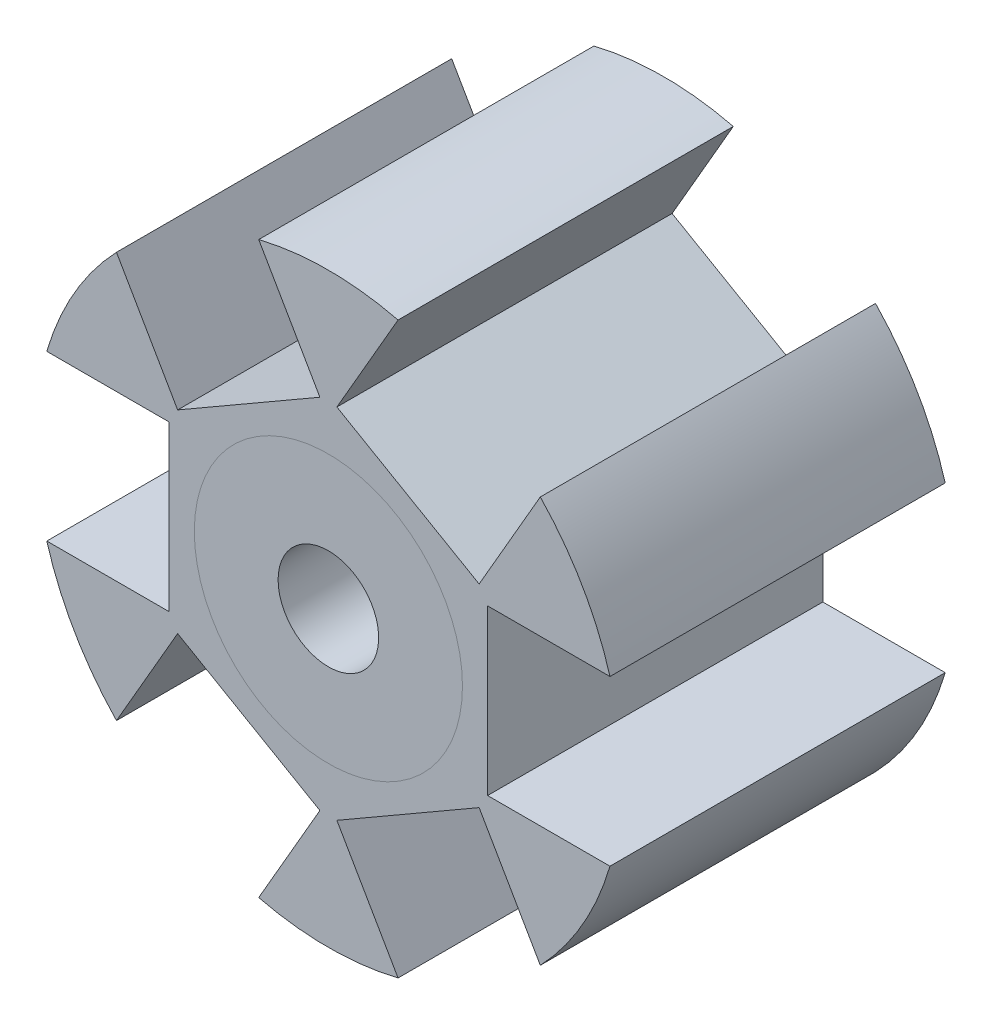
ISO-10303-21;
HEADER;
FILE_DESCRIPTION(('STEP AP214'),'2;1');
FILE_NAME('part.step','',(''),(''),'','','');
FILE_SCHEMA(('AUTOMOTIVE_DESIGN { 1 0 10303 214 1 1 1 1 }'));
ENDSEC;
DATA;
#1=APPLICATION_CONTEXT('core data for automotive mechanical design processes');
#2=APPLICATION_PROTOCOL_DEFINITION('international standard','automotive_design',2000,#1);
#3=PRODUCT_CONTEXT('',#1,'mechanical');
#4=PRODUCT('Part','Part','',(#3));
#5=PRODUCT_RELATED_PRODUCT_CATEGORY('part','',(#4));
#6=PRODUCT_DEFINITION_FORMATION('','',#4);
#7=PRODUCT_DEFINITION_CONTEXT('part definition',#1,'design');
#8=PRODUCT_DEFINITION('design','',#6,#7);
#9=PRODUCT_DEFINITION_SHAPE('','',#8);
#10=(LENGTH_UNIT() NAMED_UNIT(*) SI_UNIT(.MILLI.,.METRE.));
#11=(NAMED_UNIT(*) PLANE_ANGLE_UNIT() SI_UNIT($,.RADIAN.));
#12=(NAMED_UNIT(*) SI_UNIT($,.STERADIAN.) SOLID_ANGLE_UNIT());
#13=UNCERTAINTY_MEASURE_WITH_UNIT(LENGTH_MEASURE(1.E-05),#10,'distance_accuracy_value','');
#14=(GEOMETRIC_REPRESENTATION_CONTEXT(3) GLOBAL_UNCERTAINTY_ASSIGNED_CONTEXT((#13)) GLOBAL_UNIT_ASSIGNED_CONTEXT((#10,
#11,#12)) REPRESENTATION_CONTEXT('',''));
#15=CARTESIAN_POINT('',(0.,0.,0.));
#16=DIRECTION('',(0.,0.,1.));
#17=DIRECTION('',(1.,0.,0.));
#18=AXIS2_PLACEMENT_3D('',#15,#16,#17);
#19=CARTESIAN_POINT('',(0.,0.,2.));
#20=DIRECTION('',(0.,0.,1.));
#21=DIRECTION('',(-1.,0.,0.));
#22=AXIS2_PLACEMENT_3D('',#19,#20,#21);
#23=CYLINDRICAL_SURFACE('',#22,4.);
#24=CARTESIAN_POINT('',(0.,0.,5.));
#25=DIRECTION('',(0.,0.,-1.));
#26=DIRECTION('',(-1.,0.,0.));
#27=AXIS2_PLACEMENT_3D('',#24,#25,#26);
#28=CIRCLE('',#27,4.);
#29=CARTESIAN_POINT('',(-4.,0.,5.));
#30=VERTEX_POINT('',#29);
#31=EDGE_CURVE('P0_E52',#30,#30,#28,.T.);
#32=ORIENTED_EDGE('',*,*,#31,.T.);
#33=EDGE_LOOP('',(#32));
#34=FACE_BOUND('',#33,.T.);
#35=CARTESIAN_POINT('',(0.,0.,2.));
#36=DIRECTION('',(0.,0.,-1.));
#37=DIRECTION('',(-1.,0.,0.));
#38=AXIS2_PLACEMENT_3D('',#35,#36,#37);
#39=CIRCLE('',#38,4.);
#40=CARTESIAN_POINT('',(-4.,0.,2.));
#41=VERTEX_POINT('',#40);
#42=EDGE_CURVE('P0_E11',#41,#41,#39,.T.);
#43=ORIENTED_EDGE('',*,*,#42,.F.);
#44=EDGE_LOOP('',(#43));
#45=FACE_BOUND('',#44,.T.);
#46=ADVANCED_FACE('P0_F49',(#34,#45),#23,.T.);
#47=CARTESIAN_POINT('',(0.,0.,2.));
#48=DIRECTION('',(0.,0.,1.));
#49=DIRECTION('',(-1.,0.,0.));
#50=AXIS2_PLACEMENT_3D('',#47,#48,#49);
#51=PLANE('',#50);
#52=CARTESIAN_POINT('',(0.,0.,2.));
#53=DIRECTION('',(0.,0.,-1.));
#54=DIRECTION('',(-1.,0.,0.));
#55=AXIS2_PLACEMENT_3D('',#52,#53,#54);
#56=CIRCLE('',#55,1.5);
#57=CARTESIAN_POINT('',(-1.5,0.,2.));
#58=VERTEX_POINT('',#57);
#59=EDGE_CURVE('P0_E59',#58,#58,#56,.T.);
#60=ORIENTED_EDGE('',*,*,#59,.F.);
#61=EDGE_LOOP('',(#60));
#62=FACE_BOUND('',#61,.T.);
#63=ORIENTED_EDGE('',*,*,#42,.T.);
#64=EDGE_LOOP('',(#63));
#65=FACE_BOUND('',#64,.T.);
#66=ADVANCED_FACE('P0_F70',(#62,#65),#51,.F.);
#67=CARTESIAN_POINT('',(0.,0.,5.));
#68=DIRECTION('',(0.,0.,1.));
#69=DIRECTION('',(-1.,0.,0.));
#70=AXIS2_PLACEMENT_3D('',#67,#68,#69);
#71=PLANE('',#70);
#72=CARTESIAN_POINT('',(0.,0.,5.));
#73=DIRECTION('',(0.,0.,-1.));
#74=DIRECTION('',(-1.,0.,0.));
#75=AXIS2_PLACEMENT_3D('',#72,#73,#74);
#76=CIRCLE('',#75,1.5);
#77=CARTESIAN_POINT('',(-1.5,0.,5.));
#78=VERTEX_POINT('',#77);
#79=EDGE_CURVE('P0_E61',#78,#78,#76,.T.);
#80=ORIENTED_EDGE('',*,*,#79,.T.);
#81=EDGE_LOOP('',(#80));
#82=FACE_BOUND('',#81,.T.);
#83=ORIENTED_EDGE('',*,*,#31,.F.);
#84=EDGE_LOOP('',(#83));
#85=FACE_BOUND('',#84,.T.);
#86=ADVANCED_FACE('P0_F72',(#82,#85),#71,.T.);
#87=CARTESIAN_POINT('',(0.,0.,2.));
#88=DIRECTION('',(0.,0.,1.));
#89=DIRECTION('',(-1.,0.,0.));
#90=AXIS2_PLACEMENT_3D('',#87,#88,#89);
#91=CYLINDRICAL_SURFACE('',#90,1.5);
#92=ORIENTED_EDGE('',*,*,#59,.T.);
#93=EDGE_LOOP('',(#92));
#94=FACE_BOUND('',#93,.T.);
#95=ORIENTED_EDGE('',*,*,#79,.F.);
#96=EDGE_LOOP('',(#95));
#97=FACE_BOUND('',#96,.T.);
#98=ADVANCED_FACE('P0_F67',(#94,#97),#91,.F.);
#99=CLOSED_SHELL('',(#46,#66,#86,#98));
#100=MANIFOLD_SOLID_BREP('P0_B2',#99);
#101=CARTESIAN_POINT('',(0.,0.,-2.));
#102=DIRECTION('',(0.,0.,-1.));
#103=DIRECTION('',(-1.,0.,0.));
#104=AXIS2_PLACEMENT_3D('',#101,#102,#103);
#105=CYLINDRICAL_SURFACE('',#104,4.);
#106=CARTESIAN_POINT('',(0.,0.,-5.));
#107=DIRECTION('',(0.,0.,-1.));
#108=DIRECTION('',(-1.,0.,0.));
#109=AXIS2_PLACEMENT_3D('',#106,#107,#108);
#110=CIRCLE('',#109,4.);
#111=CARTESIAN_POINT('',(-4.,0.,-5.));
#112=VERTEX_POINT('',#111);
#113=EDGE_CURVE('P0_E117',#112,#112,#110,.T.);
#114=ORIENTED_EDGE('',*,*,#113,.F.);
#115=EDGE_LOOP('',(#114));
#116=FACE_BOUND('',#115,.T.);
#117=CARTESIAN_POINT('',(0.,0.,-2.));
#118=DIRECTION('',(0.,0.,-1.));
#119=DIRECTION('',(-1.,0.,0.));
#120=AXIS2_PLACEMENT_3D('',#117,#118,#119);
#121=CIRCLE('',#120,4.);
#122=CARTESIAN_POINT('',(-4.,0.,-2.));
#123=VERTEX_POINT('',#122);
#124=EDGE_CURVE('P0_E48',#123,#123,#121,.T.);
#125=ORIENTED_EDGE('',*,*,#124,.T.);
#126=EDGE_LOOP('',(#125));
#127=FACE_BOUND('',#126,.T.);
#128=ADVANCED_FACE('P0_F114',(#116,#127),#105,.T.);
#129=CARTESIAN_POINT('',(0.,0.,-2.));
#130=DIRECTION('',(0.,0.,-1.));
#131=DIRECTION('',(-1.,0.,0.));
#132=AXIS2_PLACEMENT_3D('',#129,#130,#131);
#133=PLANE('',#132);
#134=CARTESIAN_POINT('',(0.,0.,-2.));
#135=DIRECTION('',(0.,0.,-1.));
#136=DIRECTION('',(-1.,0.,0.));
#137=AXIS2_PLACEMENT_3D('',#134,#135,#136);
#138=CIRCLE('',#137,1.5);
#139=CARTESIAN_POINT('',(-1.5,0.,-2.));
#140=VERTEX_POINT('',#139);
#141=EDGE_CURVE('P0_E124',#140,#140,#138,.T.);
#142=ORIENTED_EDGE('',*,*,#141,.T.);
#143=EDGE_LOOP('',(#142));
#144=FACE_BOUND('',#143,.T.);
#145=ORIENTED_EDGE('',*,*,#124,.F.);
#146=EDGE_LOOP('',(#145));
#147=FACE_BOUND('',#146,.T.);
#148=ADVANCED_FACE('P0_F132',(#144,#147),#133,.F.);
#149=CARTESIAN_POINT('',(0.,0.,-5.));
#150=DIRECTION('',(0.,0.,-1.));
#151=DIRECTION('',(-1.,0.,0.));
#152=AXIS2_PLACEMENT_3D('',#149,#150,#151);
#153=PLANE('',#152);
#154=CARTESIAN_POINT('',(0.,0.,-5.));
#155=DIRECTION('',(0.,0.,-1.));
#156=DIRECTION('',(-1.,0.,0.));
#157=AXIS2_PLACEMENT_3D('',#154,#155,#156);
#158=CIRCLE('',#157,1.5);
#159=CARTESIAN_POINT('',(-1.5,0.,-5.));
#160=VERTEX_POINT('',#159);
#161=EDGE_CURVE('P0_E126',#160,#160,#158,.T.);
#162=ORIENTED_EDGE('',*,*,#161,.F.);
#163=EDGE_LOOP('',(#162));
#164=FACE_BOUND('',#163,.T.);
#165=ORIENTED_EDGE('',*,*,#113,.T.);
#166=EDGE_LOOP('',(#165));
#167=FACE_BOUND('',#166,.T.);
#168=ADVANCED_FACE('P0_F138',(#164,#167),#153,.T.);
#169=CARTESIAN_POINT('',(0.,0.,-2.));
#170=DIRECTION('',(0.,0.,-1.));
#171=DIRECTION('',(-1.,0.,0.));
#172=AXIS2_PLACEMENT_3D('',#169,#170,#171);
#173=CYLINDRICAL_SURFACE('',#172,1.5);
#174=ORIENTED_EDGE('',*,*,#141,.F.);
#175=EDGE_LOOP('',(#174));
#176=FACE_BOUND('',#175,.T.);
#177=ORIENTED_EDGE('',*,*,#161,.T.);
#178=EDGE_LOOP('',(#177));
#179=FACE_BOUND('',#178,.T.);
#180=ADVANCED_FACE('P0_F135',(#176,#179),#173,.F.);
#181=CLOSED_SHELL('',(#128,#148,#168,#180));
#182=MANIFOLD_SOLID_BREP('P0_B6',#181);
#183=CARTESIAN_POINT('',(-2.37500000000005,4.11362066797605,0.));
#184=DIRECTION('',(-0.50000000000001,0.866025403784433,0.));
#185=DIRECTION('',(0.,0.,1.));
#186=AXIS2_PLACEMENT_3D('',#183,#184,#185);
#187=PLANE('',#186);
#188=DIRECTION('',(0.,0.,-1.));
#189=VECTOR('',#188,1.);
#190=CARTESIAN_POINT('',(-4.49676223927191,2.88862066797603,5.));
#191=LINE('',#190,#189);
#192=CARTESIAN_POINT('',(-4.49676223927191,2.88862066797603,5.));
#193=VERTEX_POINT('',#192);
#194=CARTESIAN_POINT('',(-4.49676223927191,2.88862066797603,-5.));
#195=VERTEX_POINT('',#194);
#196=EDGE_CURVE('P1_E26',#193,#195,#191,.T.);
#197=ORIENTED_EDGE('',*,*,#196,.F.);
#198=DIRECTION('',(-0.866025403784433,-0.50000000000001,0.));
#199=VECTOR('',#198,1.);
#200=CARTESIAN_POINT('',(-0.253237760728186,5.33862066797608,5.));
#201=LINE('',#200,#199);
#202=CARTESIAN_POINT('',(-0.253237760728186,5.33862066797608,5.));
#203=VERTEX_POINT('',#202);
#204=EDGE_CURVE('P1_E505',#203,#193,#201,.T.);
#205=ORIENTED_EDGE('',*,*,#204,.F.);
#206=DIRECTION('',(0.,0.,1.));
#207=VECTOR('',#206,1.);
#208=CARTESIAN_POINT('',(-0.253237760728186,5.33862066797608,5.));
#209=LINE('',#208,#207);
#210=CARTESIAN_POINT('',(-0.253237760728186,5.33862066797608,-5.));
#211=VERTEX_POINT('',#210);
#212=EDGE_CURVE('P1_E11',#211,#203,#209,.T.);
#213=ORIENTED_EDGE('',*,*,#212,.F.);
#214=DIRECTION('',(0.866025403784433,0.50000000000001,0.));
#215=VECTOR('',#214,1.);
#216=CARTESIAN_POINT('',(-0.253237760728186,5.33862066797608,-5.));
#217=LINE('',#216,#215);
#218=EDGE_CURVE('P1_E366',#195,#211,#217,.T.);
#219=ORIENTED_EDGE('',*,*,#218,.F.);
#220=EDGE_LOOP('',(#197,#205,#213,#219));
#221=FACE_BOUND('',#220,.T.);
#222=ADVANCED_FACE('P1_F17',(#221),#187,.T.);
#223=CARTESIAN_POINT('',(-0.253237760728186,5.33862066797608,5.));
#224=DIRECTION('',(-0.866025403784433,-0.50000000000001,0.));
#225=DIRECTION('',(-0.50000000000001,0.866025403784433,0.));
#226=AXIS2_PLACEMENT_3D('',#223,#224,#225);
#227=PLANE('',#226);
#228=DIRECTION('',(0.,0.,-1.));
#229=VECTOR('',#228,1.);
#230=CARTESIAN_POINT('',(-2.07823776072823,8.49961339178926,5.));
#231=LINE('',#230,#229);
#232=CARTESIAN_POINT('',(-2.07823776072823,8.49961339178926,5.));
#233=VERTEX_POINT('',#232);
#234=CARTESIAN_POINT('',(-2.07823776072823,8.49961339178926,-5.));
#235=VERTEX_POINT('',#234);
#236=EDGE_CURVE('P1_E343',#233,#235,#231,.T.);
#237=ORIENTED_EDGE('',*,*,#236,.T.);
#238=DIRECTION('',(-0.50000000000001,0.866025403784433,0.));
#239=VECTOR('',#238,1.);
#240=CARTESIAN_POINT('',(-0.253237760728186,5.33862066797608,-5.));
#241=LINE('',#240,#239);
#242=EDGE_CURVE('P1_E370',#211,#235,#241,.T.);
#243=ORIENTED_EDGE('',*,*,#242,.F.);
#244=ORIENTED_EDGE('',*,*,#212,.T.);
#245=DIRECTION('',(-0.50000000000001,0.866025403784433,0.));
#246=VECTOR('',#245,1.);
#247=CARTESIAN_POINT('',(-0.253237760728186,5.33862066797608,5.));
#248=LINE('',#247,#246);
#249=EDGE_CURVE('P1_E355',#203,#233,#248,.T.);
#250=ORIENTED_EDGE('',*,*,#249,.T.);
#251=EDGE_LOOP('',(#237,#243,#244,#250));
#252=FACE_BOUND('',#251,.T.);
#253=ADVANCED_FACE('P1_F803',(#252),#227,.T.);
#254=CARTESIAN_POINT('',(-4.49676223927191,2.88862066797603,5.));
#255=DIRECTION('',(0.866025403784433,0.50000000000001,0.));
#256=DIRECTION('',(0.,0.,-1.));
#257=AXIS2_PLACEMENT_3D('',#254,#255,#256);
#258=PLANE('',#257);
#259=DIRECTION('',(0.,0.,1.));
#260=VECTOR('',#259,1.);
#261=CARTESIAN_POINT('',(-6.32176223927195,6.04961339178921,5.));
#262=LINE('',#261,#260);
#263=CARTESIAN_POINT('',(-6.32176223927195,6.04961339178921,-5.));
#264=VERTEX_POINT('',#263);
#265=CARTESIAN_POINT('',(-6.32176223927195,6.04961339178921,5.));
#266=VERTEX_POINT('',#265);
#267=EDGE_CURVE('P1_E439',#264,#266,#262,.T.);
#268=ORIENTED_EDGE('',*,*,#267,.T.);
#269=DIRECTION('',(-0.50000000000001,0.866025403784433,0.));
#270=VECTOR('',#269,1.);
#271=CARTESIAN_POINT('',(-4.49676223927191,2.88862066797603,5.));
#272=LINE('',#271,#270);
#273=EDGE_CURVE('P1_E488',#193,#266,#272,.T.);
#274=ORIENTED_EDGE('',*,*,#273,.F.);
#275=ORIENTED_EDGE('',*,*,#196,.T.);
#276=DIRECTION('',(-0.50000000000001,0.866025403784433,0.));
#277=VECTOR('',#276,1.);
#278=CARTESIAN_POINT('',(-4.49676223927191,2.88862066797603,-5.));
#279=LINE('',#278,#277);
#280=EDGE_CURVE('P1_E362',#195,#264,#279,.T.);
#281=ORIENTED_EDGE('',*,*,#280,.T.);
#282=EDGE_LOOP('',(#268,#274,#275,#281));
#283=FACE_BOUND('',#282,.T.);
#284=ADVANCED_FACE('P1_F19',(#283),#258,.T.);
#285=CARTESIAN_POINT('',(2.37499999999996,4.1136206679761,0.));
#286=DIRECTION('',(0.499999999999992,0.866025403784443,0.));
#287=DIRECTION('',(0.,0.,-1.));
#288=AXIS2_PLACEMENT_3D('',#285,#286,#287);
#289=PLANE('',#288);
#290=DIRECTION('',(0.,0.,-1.));
#291=VECTOR('',#290,1.);
#292=CARTESIAN_POINT('',(0.253237760728075,5.33862066797609,5.));
#293=LINE('',#292,#291);
#294=CARTESIAN_POINT('',(0.253237760728075,5.33862066797609,5.));
#295=VERTEX_POINT('',#294);
#296=CARTESIAN_POINT('',(0.253237760728075,5.33862066797609,-5.));
#297=VERTEX_POINT('',#296);
#298=EDGE_CURVE('P1_E342',#295,#297,#293,.T.);
#299=ORIENTED_EDGE('',*,*,#298,.F.);
#300=DIRECTION('',(-0.866025403784443,0.499999999999992,0.));
#301=VECTOR('',#300,1.);
#302=CARTESIAN_POINT('',(4.49676223927185,2.88862066797613,5.));
#303=LINE('',#302,#301);
#304=CARTESIAN_POINT('',(4.49676223927185,2.88862066797613,5.));
#305=VERTEX_POINT('',#304);
#306=EDGE_CURVE('P1_E338',#305,#295,#303,.T.);
#307=ORIENTED_EDGE('',*,*,#306,.F.);
#308=DIRECTION('',(0.,0.,1.));
#309=VECTOR('',#308,1.);
#310=CARTESIAN_POINT('',(4.49676223927185,2.88862066797613,5.));
#311=LINE('',#310,#309);
#312=CARTESIAN_POINT('',(4.49676223927185,2.88862066797613,-5.));
#313=VERTEX_POINT('',#312);
#314=EDGE_CURVE('P1_E339',#313,#305,#311,.T.);
#315=ORIENTED_EDGE('',*,*,#314,.F.);
#316=DIRECTION('',(0.866025403784443,-0.499999999999992,0.));
#317=VECTOR('',#316,1.);
#318=CARTESIAN_POINT('',(4.49676223927185,2.88862066797613,-5.));
#319=LINE('',#318,#317);
#320=EDGE_CURVE('P1_E382',#297,#313,#319,.T.);
#321=ORIENTED_EDGE('',*,*,#320,.F.);
#322=EDGE_LOOP('',(#299,#307,#315,#321));
#323=FACE_BOUND('',#322,.T.);
#324=ADVANCED_FACE('P1_F936',(#323),#289,.T.);
#325=CARTESIAN_POINT('',(4.49676223927185,2.88862066797613,5.));
#326=DIRECTION('',(-0.866025403784443,0.499999999999992,0.));
#327=DIRECTION('',(0.,0.,1.));
#328=AXIS2_PLACEMENT_3D('',#325,#326,#327);
#329=PLANE('',#328);
#330=DIRECTION('',(0.,0.,-1.));
#331=VECTOR('',#330,1.);
#332=CARTESIAN_POINT('',(6.32176223927182,6.04961339178935,5.));
#333=LINE('',#332,#331);
#334=CARTESIAN_POINT('',(6.32176223927182,6.04961339178935,5.));
#335=VERTEX_POINT('',#334);
#336=CARTESIAN_POINT('',(6.32176223927182,6.04961339178935,-5.));
#337=VERTEX_POINT('',#336);
#338=EDGE_CURVE('P1_E449',#335,#337,#333,.T.);
#339=ORIENTED_EDGE('',*,*,#338,.T.);
#340=DIRECTION('',(0.499999999999992,0.866025403784443,0.));
#341=VECTOR('',#340,1.);
#342=CARTESIAN_POINT('',(4.49676223927185,2.88862066797613,-5.));
#343=LINE('',#342,#341);
#344=EDGE_CURVE('P1_E386',#313,#337,#343,.T.);
#345=ORIENTED_EDGE('',*,*,#344,.F.);
#346=ORIENTED_EDGE('',*,*,#314,.T.);
#347=DIRECTION('',(0.499999999999992,0.866025403784443,0.));
#348=VECTOR('',#347,1.);
#349=CARTESIAN_POINT('',(4.49676223927185,2.88862066797613,5.));
#350=LINE('',#349,#348);
#351=EDGE_CURVE('P1_E334',#305,#335,#350,.T.);
#352=ORIENTED_EDGE('',*,*,#351,.T.);
#353=EDGE_LOOP('',(#339,#345,#346,#352));
#354=FACE_BOUND('',#353,.T.);
#355=ADVANCED_FACE('P1_F927',(#354),#329,.T.);
#356=CARTESIAN_POINT('',(0.253237760728075,5.33862066797609,5.));
#357=DIRECTION('',(0.866025403784443,-0.499999999999992,0.));
#358=DIRECTION('',(0.,0.,-1.));
#359=AXIS2_PLACEMENT_3D('',#356,#357,#358);
#360=PLANE('',#359);
#361=DIRECTION('',(0.,0.,1.));
#362=VECTOR('',#361,1.);
#363=CARTESIAN_POINT('',(2.07823776072805,8.49961339178931,5.));
#364=LINE('',#363,#362);
#365=CARTESIAN_POINT('',(2.07823776072805,8.49961339178931,-5.));
#366=VERTEX_POINT('',#365);
#367=CARTESIAN_POINT('',(2.07823776072805,8.49961339178931,5.));
#368=VERTEX_POINT('',#367);
#369=EDGE_CURVE('P1_E346',#366,#368,#364,.T.);
#370=ORIENTED_EDGE('',*,*,#369,.T.);
#371=DIRECTION('',(0.499999999999992,0.866025403784443,0.));
#372=VECTOR('',#371,1.);
#373=CARTESIAN_POINT('',(0.253237760728075,5.33862066797609,5.));
#374=LINE('',#373,#372);
#375=EDGE_CURVE('P1_E350',#295,#368,#374,.T.);
#376=ORIENTED_EDGE('',*,*,#375,.F.);
#377=ORIENTED_EDGE('',*,*,#298,.T.);
#378=DIRECTION('',(0.499999999999992,0.866025403784443,0.));
#379=VECTOR('',#378,1.);
#380=CARTESIAN_POINT('',(0.253237760728075,5.33862066797609,-5.));
#381=LINE('',#380,#379);
#382=EDGE_CURVE('P1_E378',#297,#366,#381,.T.);
#383=ORIENTED_EDGE('',*,*,#382,.T.);
#384=EDGE_LOOP('',(#370,#376,#377,#383));
#385=FACE_BOUND('',#384,.T.);
#386=ADVANCED_FACE('P1_F918',(#385),#360,.T.);
#387=CARTESIAN_POINT('',(4.75,0.,0.));
#388=DIRECTION('',(1.,0.,0.));
#389=DIRECTION('',(0.,1.,0.));
#390=AXIS2_PLACEMENT_3D('',#387,#388,#389);
#391=PLANE('',#390);
#392=DIRECTION('',(0.,0.,-1.));
#393=VECTOR('',#392,1.);
#394=CARTESIAN_POINT('',(4.75,2.45,5.));
#395=LINE('',#394,#393);
#396=CARTESIAN_POINT('',(4.75,2.45,5.));
#397=VERTEX_POINT('',#396);
#398=CARTESIAN_POINT('',(4.75,2.45,-5.));
#399=VERTEX_POINT('',#398);
#400=EDGE_CURVE('P1_E319',#397,#399,#395,.T.);
#401=ORIENTED_EDGE('',*,*,#400,.F.);
#402=DIRECTION('',(0.,1.,0.));
#403=VECTOR('',#402,1.);
#404=CARTESIAN_POINT('',(4.75,-2.45,5.));
#405=LINE('',#404,#403);
#406=CARTESIAN_POINT('',(4.75,-2.45,5.));
#407=VERTEX_POINT('',#406);
#408=EDGE_CURVE('P1_E318',#407,#397,#405,.T.);
#409=ORIENTED_EDGE('',*,*,#408,.F.);
#410=DIRECTION('',(0.,0.,1.));
#411=VECTOR('',#410,1.);
#412=CARTESIAN_POINT('',(4.75,-2.45,5.));
#413=LINE('',#412,#411);
#414=CARTESIAN_POINT('',(4.75,-2.45,-5.));
#415=VERTEX_POINT('',#414);
#416=EDGE_CURVE('P1_E322',#415,#407,#413,.T.);
#417=ORIENTED_EDGE('',*,*,#416,.F.);
#418=DIRECTION('',(0.,-1.,0.));
#419=VECTOR('',#418,1.);
#420=CARTESIAN_POINT('',(4.75,-2.45,-5.));
#421=LINE('',#420,#419);
#422=EDGE_CURVE('P1_E395',#399,#415,#421,.T.);
#423=ORIENTED_EDGE('',*,*,#422,.F.);
#424=EDGE_LOOP('',(#401,#409,#417,#423));
#425=FACE_BOUND('',#424,.T.);
#426=ADVANCED_FACE('P1_F909',(#425),#391,.T.);
#427=CARTESIAN_POINT('',(4.75,-2.45,5.));
#428=DIRECTION('',(0.,1.,0.));
#429=DIRECTION('',(1.,0.,0.));
#430=AXIS2_PLACEMENT_3D('',#427,#428,#429);
#431=PLANE('',#430);
#432=DIRECTION('',(0.,0.,-1.));
#433=VECTOR('',#432,1.);
#434=CARTESIAN_POINT('',(8.4,-2.45,5.));
#435=LINE('',#434,#433);
#436=CARTESIAN_POINT('',(8.4,-2.45,5.));
#437=VERTEX_POINT('',#436);
#438=CARTESIAN_POINT('',(8.4,-2.45,-5.));
#439=VERTEX_POINT('',#438);
#440=EDGE_CURVE('P1_E444',#437,#439,#435,.T.);
#441=ORIENTED_EDGE('',*,*,#440,.T.);
#442=DIRECTION('',(1.,0.,0.));
#443=VECTOR('',#442,1.);
#444=CARTESIAN_POINT('',(4.75,-2.45,-5.));
#445=LINE('',#444,#443);
#446=EDGE_CURVE('P1_E297',#415,#439,#445,.T.);
#447=ORIENTED_EDGE('',*,*,#446,.F.);
#448=ORIENTED_EDGE('',*,*,#416,.T.);
#449=DIRECTION('',(1.,0.,0.));
#450=VECTOR('',#449,1.);
#451=CARTESIAN_POINT('',(4.75,-2.45,5.));
#452=LINE('',#451,#450);
#453=EDGE_CURVE('P1_E314',#407,#437,#452,.T.);
#454=ORIENTED_EDGE('',*,*,#453,.T.);
#455=EDGE_LOOP('',(#441,#447,#448,#454));
#456=FACE_BOUND('',#455,.T.);
#457=ADVANCED_FACE('P1_F900',(#456),#431,.T.);
#458=CARTESIAN_POINT('',(4.75,2.45,5.));
#459=DIRECTION('',(0.,-1.,0.));
#460=DIRECTION('',(0.,0.,-1.));
#461=AXIS2_PLACEMENT_3D('',#458,#459,#460);
#462=PLANE('',#461);
#463=DIRECTION('',(0.,0.,1.));
#464=VECTOR('',#463,1.);
#465=CARTESIAN_POINT('',(8.4,2.45,5.));
#466=LINE('',#465,#464);
#467=CARTESIAN_POINT('',(8.4,2.45,-5.));
#468=VERTEX_POINT('',#467);
#469=CARTESIAN_POINT('',(8.4,2.45,5.));
#470=VERTEX_POINT('',#469);
#471=EDGE_CURVE('P1_E452',#468,#470,#466,.T.);
#472=ORIENTED_EDGE('',*,*,#471,.T.);
#473=DIRECTION('',(1.,0.,0.));
#474=VECTOR('',#473,1.);
#475=CARTESIAN_POINT('',(4.75,2.45,5.));
#476=LINE('',#475,#474);
#477=EDGE_CURVE('P1_E326',#397,#470,#476,.T.);
#478=ORIENTED_EDGE('',*,*,#477,.F.);
#479=ORIENTED_EDGE('',*,*,#400,.T.);
#480=DIRECTION('',(1.,0.,0.));
#481=VECTOR('',#480,1.);
#482=CARTESIAN_POINT('',(4.75,2.45,-5.));
#483=LINE('',#482,#481);
#484=EDGE_CURVE('P1_E391',#399,#468,#483,.T.);
#485=ORIENTED_EDGE('',*,*,#484,.T.);
#486=EDGE_LOOP('',(#472,#478,#479,#485));
#487=FACE_BOUND('',#486,.T.);
#488=ADVANCED_FACE('P1_F891',(#487),#462,.T.);
#489=CARTESIAN_POINT('',(2.375,-4.11362066797607,0.));
#490=DIRECTION('',(0.5,-0.866025403784436,0.));
#491=DIRECTION('',(0.,0.,-1.));
#492=AXIS2_PLACEMENT_3D('',#489,#490,#491);
#493=PLANE('',#492);
#494=DIRECTION('',(0.,0.,-1.));
#495=VECTOR('',#494,1.);
#496=CARTESIAN_POINT('',(4.49676223927189,-2.88862066797607,5.));
#497=LINE('',#496,#495);
#498=CARTESIAN_POINT('',(4.49676223927189,-2.88862066797607,5.));
#499=VERTEX_POINT('',#498);
#500=CARTESIAN_POINT('',(4.49676223927189,-2.88862066797607,-5.));
#501=VERTEX_POINT('',#500);
#502=EDGE_CURVE('P1_E455',#499,#501,#497,.T.);
#503=ORIENTED_EDGE('',*,*,#502,.F.);
#504=DIRECTION('',(0.866025403784436,0.5,0.));
#505=VECTOR('',#504,1.);
#506=CARTESIAN_POINT('',(0.253237760728149,-5.33862066797608,5.));
#507=LINE('',#506,#505);
#508=CARTESIAN_POINT('',(0.253237760728149,-5.33862066797608,5.));
#509=VERTEX_POINT('',#508);
#510=EDGE_CURVE('P1_E275',#509,#499,#507,.T.);
#511=ORIENTED_EDGE('',*,*,#510,.F.);
#512=DIRECTION('',(0.,0.,1.));
#513=VECTOR('',#512,1.);
#514=CARTESIAN_POINT('',(0.253237760728149,-5.33862066797608,5.));
#515=LINE('',#514,#513);
#516=CARTESIAN_POINT('',(0.253237760728149,-5.33862066797608,-5.));
#517=VERTEX_POINT('',#516);
#518=EDGE_CURVE('P1_E270',#517,#509,#515,.T.);
#519=ORIENTED_EDGE('',*,*,#518,.F.);
#520=DIRECTION('',(-0.866025403784436,-0.5,0.));
#521=VECTOR('',#520,1.);
#522=CARTESIAN_POINT('',(0.253237760728149,-5.33862066797608,-5.));
#523=LINE('',#522,#521);
#524=EDGE_CURVE('P1_E406',#501,#517,#523,.T.);
#525=ORIENTED_EDGE('',*,*,#524,.F.);
#526=EDGE_LOOP('',(#503,#511,#519,#525));
#527=FACE_BOUND('',#526,.T.);
#528=ADVANCED_FACE('P1_F883',(#527),#493,.T.);
#529=CARTESIAN_POINT('',(0.253237760728149,-5.33862066797608,5.));
#530=DIRECTION('',(0.866025403784436,0.5,0.));
#531=DIRECTION('',(0.,0.,-1.));
#532=AXIS2_PLACEMENT_3D('',#529,#530,#531);
#533=PLANE('',#532);
#534=DIRECTION('',(0.,0.,-1.));
#535=VECTOR('',#534,1.);
#536=CARTESIAN_POINT('',(2.07823776072817,-8.49961339178928,5.));
#537=LINE('',#536,#535);
#538=CARTESIAN_POINT('',(2.07823776072817,-8.49961339178928,5.));
#539=VERTEX_POINT('',#538);
#540=CARTESIAN_POINT('',(2.07823776072817,-8.49961339178928,-5.));
#541=VERTEX_POINT('',#540);
#542=EDGE_CURVE('P1_E252',#539,#541,#537,.T.);
#543=ORIENTED_EDGE('',*,*,#542,.T.);
#544=DIRECTION('',(0.5,-0.866025403784436,0.));
#545=VECTOR('',#544,1.);
#546=CARTESIAN_POINT('',(0.253237760728149,-5.33862066797608,-5.));
#547=LINE('',#546,#545);
#548=EDGE_CURVE('P1_E410',#517,#541,#547,.T.);
#549=ORIENTED_EDGE('',*,*,#548,.F.);
#550=ORIENTED_EDGE('',*,*,#518,.T.);
#551=DIRECTION('',(0.5,-0.866025403784436,0.));
#552=VECTOR('',#551,1.);
#553=CARTESIAN_POINT('',(0.253237760728149,-5.33862066797608,5.));
#554=LINE('',#553,#552);
#555=EDGE_CURVE('P1_E268',#509,#539,#554,.T.);
#556=ORIENTED_EDGE('',*,*,#555,.T.);
#557=EDGE_LOOP('',(#543,#549,#550,#556));
#558=FACE_BOUND('',#557,.T.);
#559=ADVANCED_FACE('P1_F269',(#558),#533,.T.);
#560=CARTESIAN_POINT('',(4.49676223927189,-2.88862066797607,5.));
#561=DIRECTION('',(-0.866025403784436,-0.5,0.));
#562=DIRECTION('',(-0.5,0.866025403784436,0.));
#563=AXIS2_PLACEMENT_3D('',#560,#561,#562);
#564=PLANE('',#563);
#565=DIRECTION('',(0.,0.,1.));
#566=VECTOR('',#565,1.);
#567=CARTESIAN_POINT('',(6.3217622392719,-6.04961339178926,5.));
#568=LINE('',#567,#566);
#569=CARTESIAN_POINT('',(6.3217622392719,-6.04961339178926,-5.));
#570=VERTEX_POINT('',#569);
#571=CARTESIAN_POINT('',(6.3217622392719,-6.04961339178926,5.));
#572=VERTEX_POINT('',#571);
#573=EDGE_CURVE('P1_E265',#570,#572,#568,.T.);
#574=ORIENTED_EDGE('',*,*,#573,.T.);
#575=DIRECTION('',(0.5,-0.866025403784436,0.));
#576=VECTOR('',#575,1.);
#577=CARTESIAN_POINT('',(4.49676223927189,-2.88862066797607,5.));
#578=LINE('',#577,#576);
#579=EDGE_CURVE('P1_E306',#499,#572,#578,.T.);
#580=ORIENTED_EDGE('',*,*,#579,.F.);
#581=ORIENTED_EDGE('',*,*,#502,.T.);
#582=DIRECTION('',(0.5,-0.866025403784436,0.));
#583=VECTOR('',#582,1.);
#584=CARTESIAN_POINT('',(4.49676223927189,-2.88862066797607,-5.));
#585=LINE('',#584,#583);
#586=EDGE_CURVE('P1_E296',#501,#570,#585,.T.);
#587=ORIENTED_EDGE('',*,*,#586,.T.);
#588=EDGE_LOOP('',(#574,#580,#581,#587));
#589=FACE_BOUND('',#588,.T.);
#590=ADVANCED_FACE('P1_F867',(#589),#564,.T.);
#591=CARTESIAN_POINT('',(-2.375,-4.11362066797609,0.));
#592=DIRECTION('',(-0.5,-0.86602540378444,0.));
#593=DIRECTION('',(-0.86602540378444,0.5,0.));
#594=AXIS2_PLACEMENT_3D('',#591,#592,#593);
#595=PLANE('',#594);
#596=DIRECTION('',(0.,0.,-1.));
#597=VECTOR('',#596,1.);
#598=CARTESIAN_POINT('',(-0.253237760728112,-5.33862066797609,5.));
#599=LINE('',#598,#597);
#600=CARTESIAN_POINT('',(-0.253237760728112,-5.33862066797609,5.));
#601=VERTEX_POINT('',#600);
#602=CARTESIAN_POINT('',(-0.253237760728112,-5.33862066797609,-5.));
#603=VERTEX_POINT('',#602);
#604=EDGE_CURVE('P1_E420',#601,#603,#599,.T.);
#605=ORIENTED_EDGE('',*,*,#604,.F.);
#606=DIRECTION('',(0.86602540378444,-0.5,0.));
#607=VECTOR('',#606,1.);
#608=CARTESIAN_POINT('',(-4.49676223927187,-2.8886206679761,5.));
#609=LINE('',#608,#607);
#610=CARTESIAN_POINT('',(-4.49676223927187,-2.8886206679761,5.));
#611=VERTEX_POINT('',#610);
#612=EDGE_CURVE('P1_E289',#611,#601,#609,.T.);
#613=ORIENTED_EDGE('',*,*,#612,.F.);
#614=DIRECTION('',(0.,0.,1.));
#615=VECTOR('',#614,1.);
#616=CARTESIAN_POINT('',(-4.49676223927187,-2.8886206679761,5.));
#617=LINE('',#616,#615);
#618=CARTESIAN_POINT('',(-4.49676223927187,-2.8886206679761,-5.));
#619=VERTEX_POINT('',#618);
#620=EDGE_CURVE('P1_E458',#619,#611,#617,.T.);
#621=ORIENTED_EDGE('',*,*,#620,.F.);
#622=DIRECTION('',(-0.86602540378444,0.5,0.));
#623=VECTOR('',#622,1.);
#624=CARTESIAN_POINT('',(-4.49676223927187,-2.8886206679761,-5.));
#625=LINE('',#624,#623);
#626=EDGE_CURVE('P1_E417',#603,#619,#625,.T.);
#627=ORIENTED_EDGE('',*,*,#626,.F.);
#628=EDGE_LOOP('',(#605,#613,#621,#627));
#629=FACE_BOUND('',#628,.T.);
#630=ADVANCED_FACE('P1_F546',(#629),#595,.T.);
#631=CARTESIAN_POINT('',(-4.49676223927187,-2.8886206679761,5.));
#632=DIRECTION('',(0.86602540378444,-0.5,0.));
#633=DIRECTION('',(0.,0.,-1.));
#634=AXIS2_PLACEMENT_3D('',#631,#632,#633);
#635=PLANE('',#634);
#636=DIRECTION('',(0.,0.,-1.));
#637=VECTOR('',#636,1.);
#638=CARTESIAN_POINT('',(-6.32176223927186,-6.0496133917893,5.));
#639=LINE('',#638,#637);
#640=CARTESIAN_POINT('',(-6.32176223927186,-6.0496133917893,5.));
#641=VERTEX_POINT('',#640);
#642=CARTESIAN_POINT('',(-6.32176223927186,-6.0496133917893,-5.));
#643=VERTEX_POINT('',#642);
#644=EDGE_CURVE('P1_E462',#641,#643,#639,.T.);
#645=ORIENTED_EDGE('',*,*,#644,.T.);
#646=DIRECTION('',(-0.5,-0.86602540378444,0.));
#647=VECTOR('',#646,1.);
#648=CARTESIAN_POINT('',(-4.49676223927187,-2.8886206679761,-5.));
#649=LINE('',#648,#647);
#650=EDGE_CURVE('P1_E422',#619,#643,#649,.T.);
#651=ORIENTED_EDGE('',*,*,#650,.F.);
#652=ORIENTED_EDGE('',*,*,#620,.T.);
#653=DIRECTION('',(-0.5,-0.86602540378444,0.));
#654=VECTOR('',#653,1.);
#655=CARTESIAN_POINT('',(-4.49676223927187,-2.8886206679761,5.));
#656=LINE('',#655,#654);
#657=EDGE_CURVE('P1_E523',#611,#641,#656,.T.);
#658=ORIENTED_EDGE('',*,*,#657,.T.);
#659=EDGE_LOOP('',(#645,#651,#652,#658));
#660=FACE_BOUND('',#659,.T.);
#661=ADVANCED_FACE('P1_F541',(#660),#635,.T.);
#662=CARTESIAN_POINT('',(-0.253237760728112,-5.33862066797609,5.));
#663=DIRECTION('',(-0.86602540378444,0.5,0.));
#664=DIRECTION('',(0.,0.,1.));
#665=AXIS2_PLACEMENT_3D('',#662,#663,#664);
#666=PLANE('',#665);
#667=DIRECTION('',(0.,0.,1.));
#668=VECTOR('',#667,1.);
#669=CARTESIAN_POINT('',(-2.07823776072811,-8.49961339178929,5.));
#670=LINE('',#669,#668);
#671=CARTESIAN_POINT('',(-2.07823776072811,-8.49961339178929,-5.));
#672=VERTEX_POINT('',#671);
#673=CARTESIAN_POINT('',(-2.07823776072811,-8.49961339178929,5.));
#674=VERTEX_POINT('',#673);
#675=EDGE_CURVE('P1_E264',#672,#674,#670,.T.);
#676=ORIENTED_EDGE('',*,*,#675,.T.);
#677=DIRECTION('',(-0.5,-0.86602540378444,0.));
#678=VECTOR('',#677,1.);
#679=CARTESIAN_POINT('',(-0.253237760728112,-5.33862066797609,5.));
#680=LINE('',#679,#678);
#681=EDGE_CURVE('P1_E281',#601,#674,#680,.T.);
#682=ORIENTED_EDGE('',*,*,#681,.F.);
#683=ORIENTED_EDGE('',*,*,#604,.T.);
#684=DIRECTION('',(-0.5,-0.86602540378444,0.));
#685=VECTOR('',#684,1.);
#686=CARTESIAN_POINT('',(-0.253237760728112,-5.33862066797609,-5.));
#687=LINE('',#686,#685);
#688=EDGE_CURVE('P1_E413',#603,#672,#687,.T.);
#689=ORIENTED_EDGE('',*,*,#688,.T.);
#690=EDGE_LOOP('',(#676,#682,#683,#689));
#691=FACE_BOUND('',#690,.T.);
#692=ADVANCED_FACE('P1_F770',(#691),#666,.T.);
#693=CARTESIAN_POINT('',(-4.75,0.,0.));
#694=DIRECTION('',(-1.,0.,0.));
#695=DIRECTION('',(0.,0.,1.));
#696=AXIS2_PLACEMENT_3D('',#693,#694,#695);
#697=PLANE('',#696);
#698=DIRECTION('',(0.,0.,-1.));
#699=VECTOR('',#698,1.);
#700=CARTESIAN_POINT('',(-4.75,-2.45,5.));
#701=LINE('',#700,#699);
#702=CARTESIAN_POINT('',(-4.75,-2.45,5.));
#703=VERTEX_POINT('',#702);
#704=CARTESIAN_POINT('',(-4.75,-2.45,-5.));
#705=VERTEX_POINT('',#704);
#706=EDGE_CURVE('P1_E421',#703,#705,#701,.T.);
#707=ORIENTED_EDGE('',*,*,#706,.F.);
#708=DIRECTION('',(0.,-1.,0.));
#709=VECTOR('',#708,1.);
#710=CARTESIAN_POINT('',(-4.75,2.45,5.));
#711=LINE('',#710,#709);
#712=CARTESIAN_POINT('',(-4.75,2.45,5.));
#713=VERTEX_POINT('',#712);
#714=EDGE_CURVE('P1_E520',#713,#703,#711,.T.);
#715=ORIENTED_EDGE('',*,*,#714,.F.);
#716=DIRECTION('',(0.,0.,1.));
#717=VECTOR('',#716,1.);
#718=CARTESIAN_POINT('',(-4.75,2.45,5.));
#719=LINE('',#718,#717);
#720=CARTESIAN_POINT('',(-4.75,2.45,-5.));
#721=VERTEX_POINT('',#720);
#722=EDGE_CURVE('P1_E50',#721,#713,#719,.T.);
#723=ORIENTED_EDGE('',*,*,#722,.F.);
#724=DIRECTION('',(0.,1.,0.));
#725=VECTOR('',#724,1.);
#726=CARTESIAN_POINT('',(-4.75,2.45,-5.));
#727=LINE('',#726,#725);
#728=EDGE_CURVE('P1_E402',#705,#721,#727,.T.);
#729=ORIENTED_EDGE('',*,*,#728,.F.);
#730=EDGE_LOOP('',(#707,#715,#723,#729));
#731=FACE_BOUND('',#730,.T.);
#732=ADVANCED_FACE('P1_F765',(#731),#697,.T.);
#733=CARTESIAN_POINT('',(-4.75,2.45,5.));
#734=DIRECTION('',(0.,-1.,0.));
#735=DIRECTION('',(0.,0.,-1.));
#736=AXIS2_PLACEMENT_3D('',#733,#734,#735);
#737=PLANE('',#736);
#738=DIRECTION('',(0.,0.,-1.));
#739=VECTOR('',#738,1.);
#740=CARTESIAN_POINT('',(-8.4,2.45,5.));
#741=LINE('',#740,#739);
#742=CARTESIAN_POINT('',(-8.4,2.45,5.));
#743=VERTEX_POINT('',#742);
#744=CARTESIAN_POINT('',(-8.4,2.45,-5.));
#745=VERTEX_POINT('',#744);
#746=EDGE_CURVE('P1_E39',#743,#745,#741,.T.);
#747=ORIENTED_EDGE('',*,*,#746,.T.);
#748=DIRECTION('',(-1.,0.,0.));
#749=VECTOR('',#748,1.);
#750=CARTESIAN_POINT('',(-4.75,2.45,-5.));
#751=LINE('',#750,#749);
#752=EDGE_CURVE('P1_E303',#721,#745,#751,.T.);
#753=ORIENTED_EDGE('',*,*,#752,.F.);
#754=ORIENTED_EDGE('',*,*,#722,.T.);
#755=DIRECTION('',(-1.,0.,0.));
#756=VECTOR('',#755,1.);
#757=CARTESIAN_POINT('',(-4.75,2.45,5.));
#758=LINE('',#757,#756);
#759=EDGE_CURVE('P1_E502',#713,#743,#758,.T.);
#760=ORIENTED_EDGE('',*,*,#759,.T.);
#761=EDGE_LOOP('',(#747,#753,#754,#760));
#762=FACE_BOUND('',#761,.T.);
#763=ADVANCED_FACE('P1_F769',(#762),#737,.T.);
#764=CARTESIAN_POINT('',(-4.75,-2.45,5.));
#765=DIRECTION('',(0.,1.,0.));
#766=DIRECTION('',(1.,0.,0.));
#767=AXIS2_PLACEMENT_3D('',#764,#765,#766);
#768=PLANE('',#767);
#769=DIRECTION('',(0.,0.,1.));
#770=VECTOR('',#769,1.);
#771=CARTESIAN_POINT('',(-8.4,-2.45,5.));
#772=LINE('',#771,#770);
#773=CARTESIAN_POINT('',(-8.4,-2.45,-5.));
#774=VERTEX_POINT('',#773);
#775=CARTESIAN_POINT('',(-8.4,-2.45,5.));
#776=VERTEX_POINT('',#775);
#777=EDGE_CURVE('P1_E459',#774,#776,#772,.T.);
#778=ORIENTED_EDGE('',*,*,#777,.T.);
#779=DIRECTION('',(-1.,0.,0.));
#780=VECTOR('',#779,1.);
#781=CARTESIAN_POINT('',(-4.75,-2.45,5.));
#782=LINE('',#781,#780);
#783=EDGE_CURVE('P1_E516',#703,#776,#782,.T.);
#784=ORIENTED_EDGE('',*,*,#783,.F.);
#785=ORIENTED_EDGE('',*,*,#706,.T.);
#786=DIRECTION('',(-1.,0.,0.));
#787=VECTOR('',#786,1.);
#788=CARTESIAN_POINT('',(-4.75,-2.45,-5.));
#789=LINE('',#788,#787);
#790=EDGE_CURVE('P1_E430',#705,#774,#789,.T.);
#791=ORIENTED_EDGE('',*,*,#790,.T.);
#792=EDGE_LOOP('',(#778,#784,#785,#791));
#793=FACE_BOUND('',#792,.T.);
#794=ADVANCED_FACE('P1_F779',(#793),#768,.T.);
#795=CARTESIAN_POINT('',(0.,0.,5.));
#796=DIRECTION('',(0.,0.,-1.));
#797=DIRECTION('',(-1.,0.,0.));
#798=AXIS2_PLACEMENT_3D('',#795,#796,#797);
#799=CYLINDRICAL_SURFACE('',#798,4.);
#800=DIRECTION('',(0.,0.,-1.));
#801=VECTOR('',#800,1.);
#802=CARTESIAN_POINT('',(4.,0.,5.));
#803=LINE('',#802,#801);
#804=CARTESIAN_POINT('',(4.,0.,5.));
#805=VERTEX_POINT('',#804);
#806=CARTESIAN_POINT('',(4.,0.,-5.));
#807=VERTEX_POINT('',#806);
#808=EDGE_CURVE('P1_E1290',#805,#807,#803,.T.);
#809=ORIENTED_EDGE('',*,*,#808,.F.);
#810=CARTESIAN_POINT('',(0.,0.,5.));
#811=DIRECTION('',(0.,0.,1.));
#812=DIRECTION('',(1.,0.,0.));
#813=AXIS2_PLACEMENT_3D('',#810,#811,#812);
#814=CIRCLE('',#813,4.);
#815=CARTESIAN_POINT('',(-4.,0.,5.));
#816=VERTEX_POINT('',#815);
#817=EDGE_CURVE('P1_E359',#805,#816,#814,.T.);
#818=ORIENTED_EDGE('',*,*,#817,.T.);
#819=DIRECTION('',(0.,0.,-1.));
#820=VECTOR('',#819,1.);
#821=CARTESIAN_POINT('',(-4.,0.,5.));
#822=LINE('',#821,#820);
#823=CARTESIAN_POINT('',(-4.,0.,-5.));
#824=VERTEX_POINT('',#823);
#825=EDGE_CURVE('P1_E512',#816,#824,#822,.T.);
#826=ORIENTED_EDGE('',*,*,#825,.T.);
#827=CARTESIAN_POINT('',(0.,0.,-5.));
#828=DIRECTION('',(0.,0.,1.));
#829=DIRECTION('',(1.,0.,0.));
#830=AXIS2_PLACEMENT_3D('',#827,#828,#829);
#831=CIRCLE('',#830,4.);
#832=EDGE_CURVE('P1_E302',#807,#824,#831,.T.);
#833=ORIENTED_EDGE('',*,*,#832,.F.);
#834=EDGE_LOOP('',(#809,#818,#826,#833));
#835=FACE_BOUND('',#834,.T.);
#836=ADVANCED_FACE('P1_F775',(#835),#799,.F.);
#837=CARTESIAN_POINT('',(0.,0.,5.));
#838=DIRECTION('',(0.,0.,-1.));
#839=DIRECTION('',(-1.,0.,0.));
#840=AXIS2_PLACEMENT_3D('',#837,#838,#839);
#841=CYLINDRICAL_SURFACE('',#840,8.75);
#842=ORIENTED_EDGE('',*,*,#644,.F.);
#843=CARTESIAN_POINT('',(0.,0.,5.));
#844=DIRECTION('',(0.,0.,1.));
#845=DIRECTION('',(1.,0.,0.));
#846=AXIS2_PLACEMENT_3D('',#843,#844,#845);
#847=CIRCLE('',#846,8.75);
#848=EDGE_CURVE('P1_E519',#776,#641,#847,.T.);
#849=ORIENTED_EDGE('',*,*,#848,.F.);
#850=ORIENTED_EDGE('',*,*,#777,.F.);
#851=CARTESIAN_POINT('',(0.,0.,-5.));
#852=DIRECTION('',(0.,0.,1.));
#853=DIRECTION('',(1.,0.,0.));
#854=AXIS2_PLACEMENT_3D('',#851,#852,#853);
#855=CIRCLE('',#854,8.75);
#856=EDGE_CURVE('P1_E426',#774,#643,#855,.T.);
#857=ORIENTED_EDGE('',*,*,#856,.T.);
#858=EDGE_LOOP('',(#842,#849,#850,#857));
#859=FACE_BOUND('',#858,.T.);
#860=ADVANCED_FACE('P1_F537',(#859),#841,.T.);
#861=CARTESIAN_POINT('',(0.,0.,5.));
#862=DIRECTION('',(0.,0.,-1.));
#863=DIRECTION('',(-1.,0.,0.));
#864=AXIS2_PLACEMENT_3D('',#861,#862,#863);
#865=CYLINDRICAL_SURFACE('',#864,8.75);
#866=ORIENTED_EDGE('',*,*,#542,.F.);
#867=CARTESIAN_POINT('',(0.,0.,5.));
#868=DIRECTION('',(0.,0.,1.));
#869=DIRECTION('',(1.,0.,0.));
#870=AXIS2_PLACEMENT_3D('',#867,#868,#869);
#871=CIRCLE('',#870,8.75);
#872=EDGE_CURVE('P1_E256',#674,#539,#871,.T.);
#873=ORIENTED_EDGE('',*,*,#872,.F.);
#874=ORIENTED_EDGE('',*,*,#675,.F.);
#875=CARTESIAN_POINT('',(0.,0.,-5.));
#876=DIRECTION('',(0.,0.,1.));
#877=DIRECTION('',(1.,0.,0.));
#878=AXIS2_PLACEMENT_3D('',#875,#876,#877);
#879=CIRCLE('',#878,8.75);
#880=EDGE_CURVE('P1_E259',#672,#541,#879,.T.);
#881=ORIENTED_EDGE('',*,*,#880,.T.);
#882=EDGE_LOOP('',(#866,#873,#874,#881));
#883=FACE_BOUND('',#882,.T.);
#884=ADVANCED_FACE('P1_F254',(#883),#865,.T.);
#885=CARTESIAN_POINT('',(0.,0.,5.));
#886=DIRECTION('',(0.,0.,-1.));
#887=DIRECTION('',(-1.,0.,0.));
#888=AXIS2_PLACEMENT_3D('',#885,#886,#887);
#889=CYLINDRICAL_SURFACE('',#888,8.75);
#890=ORIENTED_EDGE('',*,*,#440,.F.);
#891=CARTESIAN_POINT('',(0.,0.,5.));
#892=DIRECTION('',(0.,0.,1.));
#893=DIRECTION('',(1.,0.,0.));
#894=AXIS2_PLACEMENT_3D('',#891,#892,#893);
#895=CIRCLE('',#894,8.75);
#896=EDGE_CURVE('P1_E310',#572,#437,#895,.T.);
#897=ORIENTED_EDGE('',*,*,#896,.F.);
#898=ORIENTED_EDGE('',*,*,#573,.F.);
#899=CARTESIAN_POINT('',(0.,0.,-5.));
#900=DIRECTION('',(0.,0.,1.));
#901=DIRECTION('',(1.,0.,0.));
#902=AXIS2_PLACEMENT_3D('',#899,#900,#901);
#903=CIRCLE('',#902,8.75);
#904=EDGE_CURVE('P1_E294',#570,#439,#903,.T.);
#905=ORIENTED_EDGE('',*,*,#904,.T.);
#906=EDGE_LOOP('',(#890,#897,#898,#905));
#907=FACE_BOUND('',#906,.T.);
#908=ADVANCED_FACE('P1_F789',(#907),#889,.T.);
#909=CARTESIAN_POINT('',(0.,0.,5.));
#910=DIRECTION('',(0.,0.,-1.));
#911=DIRECTION('',(-1.,0.,0.));
#912=AXIS2_PLACEMENT_3D('',#909,#910,#911);
#913=CYLINDRICAL_SURFACE('',#912,8.75);
#914=ORIENTED_EDGE('',*,*,#338,.F.);
#915=CARTESIAN_POINT('',(0.,0.,5.));
#916=DIRECTION('',(0.,0.,1.));
#917=DIRECTION('',(1.,0.,0.));
#918=AXIS2_PLACEMENT_3D('',#915,#916,#917);
#919=CIRCLE('',#918,8.75);
#920=EDGE_CURVE('P1_E330',#470,#335,#919,.T.);
#921=ORIENTED_EDGE('',*,*,#920,.F.);
#922=ORIENTED_EDGE('',*,*,#471,.F.);
#923=CARTESIAN_POINT('',(0.,0.,-5.));
#924=DIRECTION('',(0.,0.,1.));
#925=DIRECTION('',(1.,0.,0.));
#926=AXIS2_PLACEMENT_3D('',#923,#924,#925);
#927=CIRCLE('',#926,8.75);
#928=EDGE_CURVE('P1_E387',#468,#337,#927,.T.);
#929=ORIENTED_EDGE('',*,*,#928,.T.);
#930=EDGE_LOOP('',(#914,#921,#922,#929));
#931=FACE_BOUND('',#930,.T.);
#932=ADVANCED_FACE('P1_F785',(#931),#913,.T.);
#933=CARTESIAN_POINT('',(0.,0.,5.));
#934=DIRECTION('',(0.,0.,-1.));
#935=DIRECTION('',(-1.,0.,0.));
#936=AXIS2_PLACEMENT_3D('',#933,#934,#935);
#937=CYLINDRICAL_SURFACE('',#936,8.75);
#938=ORIENTED_EDGE('',*,*,#236,.F.);
#939=CARTESIAN_POINT('',(0.,0.,5.));
#940=DIRECTION('',(0.,0.,1.));
#941=DIRECTION('',(1.,0.,0.));
#942=AXIS2_PLACEMENT_3D('',#939,#940,#941);
#943=CIRCLE('',#942,8.75);
#944=EDGE_CURVE('P1_E354',#368,#233,#943,.T.);
#945=ORIENTED_EDGE('',*,*,#944,.F.);
#946=ORIENTED_EDGE('',*,*,#369,.F.);
#947=CARTESIAN_POINT('',(0.,0.,-5.));
#948=DIRECTION('',(0.,0.,1.));
#949=DIRECTION('',(1.,0.,0.));
#950=AXIS2_PLACEMENT_3D('',#947,#948,#949);
#951=CIRCLE('',#950,8.75);
#952=EDGE_CURVE('P1_E374',#366,#235,#951,.T.);
#953=ORIENTED_EDGE('',*,*,#952,.T.);
#954=EDGE_LOOP('',(#938,#945,#946,#953));
#955=FACE_BOUND('',#954,.T.);
#956=ADVANCED_FACE('P1_F760',(#955),#937,.T.);
#957=CARTESIAN_POINT('',(0.,0.,5.));
#958=DIRECTION('',(0.,0.,-1.));
#959=DIRECTION('',(-1.,0.,0.));
#960=AXIS2_PLACEMENT_3D('',#957,#958,#959);
#961=CYLINDRICAL_SURFACE('',#960,8.75);
#962=ORIENTED_EDGE('',*,*,#267,.F.);
#963=CARTESIAN_POINT('',(0.,0.,-5.));
#964=DIRECTION('',(0.,0.,1.));
#965=DIRECTION('',(1.,0.,0.));
#966=AXIS2_PLACEMENT_3D('',#963,#964,#965);
#967=CIRCLE('',#966,8.75);
#968=EDGE_CURVE('P1_E299',#264,#745,#967,.T.);
#969=ORIENTED_EDGE('',*,*,#968,.T.);
#970=ORIENTED_EDGE('',*,*,#746,.F.);
#971=CARTESIAN_POINT('',(0.,0.,5.));
#972=DIRECTION('',(0.,0.,1.));
#973=DIRECTION('',(1.,0.,0.));
#974=AXIS2_PLACEMENT_3D('',#971,#972,#973);
#975=CIRCLE('',#974,8.75);
#976=EDGE_CURVE('P1_E499',#266,#743,#975,.T.);
#977=ORIENTED_EDGE('',*,*,#976,.F.);
#978=EDGE_LOOP('',(#962,#969,#970,#977));
#979=FACE_BOUND('',#978,.T.);
#980=ADVANCED_FACE('P1_F496',(#979),#961,.T.);
#981=CARTESIAN_POINT('',(0.,0.,-5.));
#982=DIRECTION('',(0.,0.,1.));
#983=DIRECTION('',(1.,0.,0.));
#984=AXIS2_PLACEMENT_3D('',#981,#982,#983);
#985=PLANE('',#984);
#986=CARTESIAN_POINT('',(0.,0.,-5.));
#987=DIRECTION('',(0.,0.,1.));
#988=DIRECTION('',(1.,0.,0.));
#989=AXIS2_PLACEMENT_3D('',#986,#987,#988);
#990=CIRCLE('',#989,4.);
#991=EDGE_CURVE('P1_E1292',#824,#807,#990,.T.);
#992=ORIENTED_EDGE('',*,*,#991,.T.);
#993=ORIENTED_EDGE('',*,*,#832,.T.);
#994=EDGE_LOOP('',(#992,#993));
#995=FACE_BOUND('',#994,.T.);
#996=ORIENTED_EDGE('',*,*,#280,.F.);
#997=ORIENTED_EDGE('',*,*,#218,.T.);
#998=ORIENTED_EDGE('',*,*,#242,.T.);
#999=ORIENTED_EDGE('',*,*,#952,.F.);
#1000=ORIENTED_EDGE('',*,*,#382,.F.);
#1001=ORIENTED_EDGE('',*,*,#320,.T.);
#1002=ORIENTED_EDGE('',*,*,#344,.T.);
#1003=ORIENTED_EDGE('',*,*,#928,.F.);
#1004=ORIENTED_EDGE('',*,*,#484,.F.);
#1005=ORIENTED_EDGE('',*,*,#422,.T.);
#1006=ORIENTED_EDGE('',*,*,#446,.T.);
#1007=ORIENTED_EDGE('',*,*,#904,.F.);
#1008=ORIENTED_EDGE('',*,*,#586,.F.);
#1009=ORIENTED_EDGE('',*,*,#524,.T.);
#1010=ORIENTED_EDGE('',*,*,#548,.T.);
#1011=ORIENTED_EDGE('',*,*,#880,.F.);
#1012=ORIENTED_EDGE('',*,*,#688,.F.);
#1013=ORIENTED_EDGE('',*,*,#626,.T.);
#1014=ORIENTED_EDGE('',*,*,#650,.T.);
#1015=ORIENTED_EDGE('',*,*,#856,.F.);
#1016=ORIENTED_EDGE('',*,*,#790,.F.);
#1017=ORIENTED_EDGE('',*,*,#728,.T.);
#1018=ORIENTED_EDGE('',*,*,#752,.T.);
#1019=ORIENTED_EDGE('',*,*,#968,.F.);
#1020=EDGE_LOOP('',(#996,#997,#998,#999,#1000,#1001,#1002,#1003,#1004,#1005,#1006,#1007,#1008,
#1009,#1010,#1011,#1012,#1013,#1014,#1015,#1016,#1017,#1018,#1019));
#1021=FACE_BOUND('',#1020,.T.);
#1022=ADVANCED_FACE('P1_F494',(#995,#1021),#985,.F.);
#1023=CARTESIAN_POINT('',(0.,0.,5.));
#1024=DIRECTION('',(0.,0.,1.));
#1025=DIRECTION('',(1.,0.,0.));
#1026=AXIS2_PLACEMENT_3D('',#1023,#1024,#1025);
#1027=PLANE('',#1026);
#1028=CARTESIAN_POINT('',(0.,0.,5.));
#1029=DIRECTION('',(0.,0.,1.));
#1030=DIRECTION('',(1.,0.,0.));
#1031=AXIS2_PLACEMENT_3D('',#1028,#1029,#1030);
#1032=CIRCLE('',#1031,4.);
#1033=EDGE_CURVE('P1_E1288',#816,#805,#1032,.T.);
#1034=ORIENTED_EDGE('',*,*,#1033,.F.);
#1035=ORIENTED_EDGE('',*,*,#817,.F.);
#1036=EDGE_LOOP('',(#1034,#1035));
#1037=FACE_BOUND('',#1036,.T.);
#1038=ORIENTED_EDGE('',*,*,#204,.T.);
#1039=ORIENTED_EDGE('',*,*,#273,.T.);
#1040=ORIENTED_EDGE('',*,*,#976,.T.);
#1041=ORIENTED_EDGE('',*,*,#759,.F.);
#1042=ORIENTED_EDGE('',*,*,#714,.T.);
#1043=ORIENTED_EDGE('',*,*,#783,.T.);
#1044=ORIENTED_EDGE('',*,*,#848,.T.);
#1045=ORIENTED_EDGE('',*,*,#657,.F.);
#1046=ORIENTED_EDGE('',*,*,#612,.T.);
#1047=ORIENTED_EDGE('',*,*,#681,.T.);
#1048=ORIENTED_EDGE('',*,*,#872,.T.);
#1049=ORIENTED_EDGE('',*,*,#555,.F.);
#1050=ORIENTED_EDGE('',*,*,#510,.T.);
#1051=ORIENTED_EDGE('',*,*,#579,.T.);
#1052=ORIENTED_EDGE('',*,*,#896,.T.);
#1053=ORIENTED_EDGE('',*,*,#453,.F.);
#1054=ORIENTED_EDGE('',*,*,#408,.T.);
#1055=ORIENTED_EDGE('',*,*,#477,.T.);
#1056=ORIENTED_EDGE('',*,*,#920,.T.);
#1057=ORIENTED_EDGE('',*,*,#351,.F.);
#1058=ORIENTED_EDGE('',*,*,#306,.T.);
#1059=ORIENTED_EDGE('',*,*,#375,.T.);
#1060=ORIENTED_EDGE('',*,*,#944,.T.);
#1061=ORIENTED_EDGE('',*,*,#249,.F.);
#1062=EDGE_LOOP('',(#1038,#1039,#1040,#1041,#1042,#1043,#1044,#1045,#1046,#1047,#1048,#1049,
#1050,#1051,#1052,#1053,#1054,#1055,#1056,#1057,#1058,#1059,#1060,#1061));
#1063=FACE_BOUND('',#1062,.T.);
#1064=ADVANCED_FACE('P1_F278',(#1037,#1063),#1027,.T.);
#1065=CARTESIAN_POINT('',(0.,0.,5.));
#1066=DIRECTION('',(0.,0.,-1.));
#1067=DIRECTION('',(-1.,0.,0.));
#1068=AXIS2_PLACEMENT_3D('',#1065,#1066,#1067);
#1069=CYLINDRICAL_SURFACE('',#1068,4.);
#1070=ORIENTED_EDGE('',*,*,#1033,.T.);
#1071=ORIENTED_EDGE('',*,*,#808,.T.);
#1072=ORIENTED_EDGE('',*,*,#991,.F.);
#1073=ORIENTED_EDGE('',*,*,#825,.F.);
#1074=EDGE_LOOP('',(#1070,#1071,#1072,#1073));
#1075=FACE_BOUND('',#1074,.T.);
#1076=ADVANCED_FACE('P1_F732',(#1075),#1069,.F.);
#1077=CLOSED_SHELL('',(#222,#253,#284,#324,#355,#386,#426,#457,#488,#528,#559,#590,#630,#661,
#692,#732,#763,#794,#836,#860,#884,#908,#932,#956,#980,#1022,#1064,#1076));
#1078=MANIFOLD_SOLID_BREP('P1_B1',#1077);
#1079=ADVANCED_BREP_SHAPE_REPRESENTATION('',(#18,#100,#182,#1078),#14);
#1080=SHAPE_DEFINITION_REPRESENTATION(#9,#1079);
ENDSEC;
END-ISO-10303-21;
